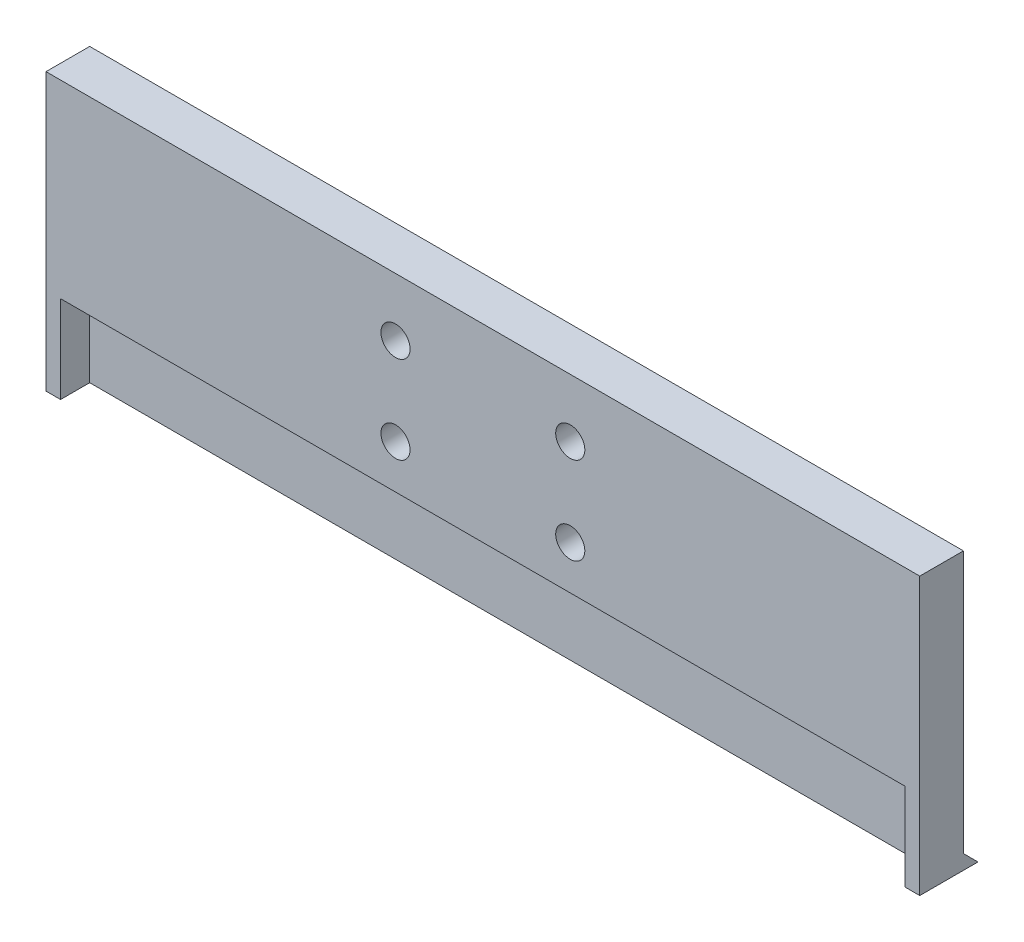
ISO-10303-21;
HEADER;
FILE_DESCRIPTION(('STEP AP214'),'2;1');
FILE_NAME('part.step','',(''),(''),'','','');
FILE_SCHEMA(('AUTOMOTIVE_DESIGN { 1 0 10303 214 1 1 1 1 }'));
ENDSEC;
DATA;
#1=APPLICATION_CONTEXT('core data for automotive mechanical design processes');
#2=APPLICATION_PROTOCOL_DEFINITION('international standard','automotive_design',2000,#1);
#3=PRODUCT_CONTEXT('',#1,'mechanical');
#4=PRODUCT('Part','Part','',(#3));
#5=PRODUCT_RELATED_PRODUCT_CATEGORY('part','',(#4));
#6=PRODUCT_DEFINITION_FORMATION('','',#4);
#7=PRODUCT_DEFINITION_CONTEXT('part definition',#1,'design');
#8=PRODUCT_DEFINITION('design','',#6,#7);
#9=PRODUCT_DEFINITION_SHAPE('','',#8);
#10=(LENGTH_UNIT() NAMED_UNIT(*) SI_UNIT(.MILLI.,.METRE.));
#11=(NAMED_UNIT(*) PLANE_ANGLE_UNIT() SI_UNIT($,.RADIAN.));
#12=(NAMED_UNIT(*) SI_UNIT($,.STERADIAN.) SOLID_ANGLE_UNIT());
#13=UNCERTAINTY_MEASURE_WITH_UNIT(LENGTH_MEASURE(1.E-05),#10,'distance_accuracy_value','');
#14=(GEOMETRIC_REPRESENTATION_CONTEXT(3) GLOBAL_UNCERTAINTY_ASSIGNED_CONTEXT((#13)) GLOBAL_UNIT_ASSIGNED_CONTEXT((#10,
#11,#12)) REPRESENTATION_CONTEXT('',''));
#15=CARTESIAN_POINT('',(0.,0.,0.));
#16=DIRECTION('',(0.,0.,1.));
#17=DIRECTION('',(1.,0.,0.));
#18=AXIS2_PLACEMENT_3D('',#15,#16,#17);
#19=CARTESIAN_POINT('',(0.,0.,0.));
#20=DIRECTION('',(0.,0.,-1.));
#21=DIRECTION('',(-1.,0.,0.));
#22=AXIS2_PLACEMENT_3D('',#19,#20,#21);
#23=PLANE('',#22);
#24=CARTESIAN_POINT('',(120.,75.,0.));
#25=DIRECTION('',(0.,0.,-1.));
#26=DIRECTION('',(-1.,0.,0.));
#27=AXIS2_PLACEMENT_3D('',#24,#25,#26);
#28=CIRCLE('',#27,5.00000000000001);
#29=CARTESIAN_POINT('',(115.,75.,0.));
#30=VERTEX_POINT('',#29);
#31=EDGE_CURVE('E135',#30,#30,#28,.T.);
#32=ORIENTED_EDGE('',*,*,#31,.F.);
#33=EDGE_LOOP('',(#32));
#34=FACE_BOUND('',#33,.T.);
#35=CARTESIAN_POINT('',(120.,45.,0.));
#36=DIRECTION('',(0.,0.,-1.));
#37=DIRECTION('',(-1.,0.,0.));
#38=AXIS2_PLACEMENT_3D('',#35,#36,#37);
#39=CIRCLE('',#38,5.00000000000001);
#40=CARTESIAN_POINT('',(115.,45.,0.));
#41=VERTEX_POINT('',#40);
#42=EDGE_CURVE('E140',#41,#41,#39,.T.);
#43=ORIENTED_EDGE('',*,*,#42,.F.);
#44=EDGE_LOOP('',(#43));
#45=FACE_BOUND('',#44,.T.);
#46=CARTESIAN_POINT('',(180.,45.,0.));
#47=DIRECTION('',(0.,0.,-1.));
#48=DIRECTION('',(-1.,0.,0.));
#49=AXIS2_PLACEMENT_3D('',#46,#47,#48);
#50=CIRCLE('',#49,4.99999999999999);
#51=CARTESIAN_POINT('',(175.,45.,0.));
#52=VERTEX_POINT('',#51);
#53=EDGE_CURVE('E146',#52,#52,#50,.T.);
#54=ORIENTED_EDGE('',*,*,#53,.F.);
#55=EDGE_LOOP('',(#54));
#56=FACE_BOUND('',#55,.T.);
#57=CARTESIAN_POINT('',(180.,75.,0.));
#58=DIRECTION('',(0.,0.,-1.));
#59=DIRECTION('',(-1.,0.,0.));
#60=AXIS2_PLACEMENT_3D('',#57,#58,#59);
#61=CIRCLE('',#60,5.00000000000002);
#62=CARTESIAN_POINT('',(175.,75.,0.));
#63=VERTEX_POINT('',#62);
#64=EDGE_CURVE('E152',#63,#63,#61,.T.);
#65=ORIENTED_EDGE('',*,*,#64,.F.);
#66=EDGE_LOOP('',(#65));
#67=FACE_BOUND('',#66,.T.);
#68=DIRECTION('',(0.,1.,0.));
#69=VECTOR('',#68,1.);
#70=CARTESIAN_POINT('',(300.,0.,0.));
#71=LINE('',#70,#69);
#72=CARTESIAN_POINT('',(300.,5.,0.));
#73=VERTEX_POINT('',#72);
#74=CARTESIAN_POINT('',(300.,95.,0.));
#75=VERTEX_POINT('',#74);
#76=EDGE_CURVE('E214',#73,#75,#71,.T.);
#77=ORIENTED_EDGE('',*,*,#76,.F.);
#78=DIRECTION('',(-1.,0.,0.));
#79=VECTOR('',#78,1.);
#80=CARTESIAN_POINT('',(307.071067811865,5.,0.));
#81=LINE('',#80,#79);
#82=CARTESIAN_POINT('',(0.,5.,0.));
#83=VERTEX_POINT('',#82);
#84=EDGE_CURVE('E178',#73,#83,#81,.T.);
#85=ORIENTED_EDGE('',*,*,#84,.T.);
#86=DIRECTION('',(0.,-1.,0.));
#87=VECTOR('',#86,1.);
#88=CARTESIAN_POINT('',(0.,0.,0.));
#89=LINE('',#88,#87);
#90=CARTESIAN_POINT('',(0.,95.,0.));
#91=VERTEX_POINT('',#90);
#92=EDGE_CURVE('E186',#91,#83,#89,.T.);
#93=ORIENTED_EDGE('',*,*,#92,.F.);
#94=DIRECTION('',(-1.,0.,0.));
#95=VECTOR('',#94,1.);
#96=CARTESIAN_POINT('',(0.,95.,0.));
#97=LINE('',#96,#95);
#98=EDGE_CURVE('E219',#75,#91,#97,.T.);
#99=ORIENTED_EDGE('',*,*,#98,.F.);
#100=EDGE_LOOP('',(#77,#85,#93,#99));
#101=FACE_BOUND('',#100,.T.);
#102=ADVANCED_FACE('F35',(#34,#45,#56,#67,#101),#23,.T.);
#103=CARTESIAN_POINT('',(0.,0.,5.));
#104=DIRECTION('',(1.,0.,0.));
#105=DIRECTION('',(0.,0.,-1.));
#106=AXIS2_PLACEMENT_3D('',#103,#104,#105);
#107=PLANE('',#106);
#108=ORIENTED_EDGE('',*,*,#92,.T.);
#109=DIRECTION('',(0.,0.707106781186548,0.707106781186548));
#110=VECTOR('',#109,1.);
#111=CARTESIAN_POINT('',(0.,2.5,-2.5));
#112=LINE('',#111,#110);
#113=CARTESIAN_POINT('',(0.,0.,-5.));
#114=VERTEX_POINT('',#113);
#115=EDGE_CURVE('E57',#114,#83,#112,.T.);
#116=ORIENTED_EDGE('',*,*,#115,.F.);
#117=DIRECTION('',(0.,0.,-1.));
#118=VECTOR('',#117,1.);
#119=CARTESIAN_POINT('',(0.,0.,5.));
#120=LINE('',#119,#118);
#121=CARTESIAN_POINT('',(0.,0.,15.));
#122=VERTEX_POINT('',#121);
#123=EDGE_CURVE('E189',#122,#114,#120,.T.);
#124=ORIENTED_EDGE('',*,*,#123,.F.);
#125=DIRECTION('',(0.,-1.,0.));
#126=VECTOR('',#125,1.);
#127=CARTESIAN_POINT('',(0.,0.,15.));
#128=LINE('',#127,#126);
#129=CARTESIAN_POINT('',(0.,95.,15.));
#130=VERTEX_POINT('',#129);
#131=EDGE_CURVE('E163',#130,#122,#128,.T.);
#132=ORIENTED_EDGE('',*,*,#131,.F.);
#133=DIRECTION('',(0.,0.,-1.));
#134=VECTOR('',#133,1.);
#135=CARTESIAN_POINT('',(0.,95.,5.));
#136=LINE('',#135,#134);
#137=EDGE_CURVE('E204',#130,#91,#136,.T.);
#138=ORIENTED_EDGE('',*,*,#137,.T.);
#139=EDGE_LOOP('',(#108,#116,#124,#132,#138));
#140=FACE_BOUND('',#139,.T.);
#141=ADVANCED_FACE('F37',(#140),#107,.F.);
#142=CARTESIAN_POINT('',(0.,0.,5.));
#143=DIRECTION('',(0.,1.,0.));
#144=DIRECTION('',(0.,0.,1.));
#145=AXIS2_PLACEMENT_3D('',#142,#143,#144);
#146=PLANE('',#145);
#147=DIRECTION('',(1.,0.,0.));
#148=VECTOR('',#147,1.);
#149=CARTESIAN_POINT('',(0.,0.,15.));
#150=LINE('',#149,#148);
#151=CARTESIAN_POINT('',(295.,0.,15.));
#152=VERTEX_POINT('',#151);
#153=CARTESIAN_POINT('',(300.,0.,15.));
#154=VERTEX_POINT('',#153);
#155=EDGE_CURVE('E166',#152,#154,#150,.T.);
#156=ORIENTED_EDGE('',*,*,#155,.F.);
#157=DIRECTION('',(0.,0.,1.));
#158=VECTOR('',#157,1.);
#159=CARTESIAN_POINT('',(295.,0.,28.0208625035403));
#160=LINE('',#159,#158);
#161=CARTESIAN_POINT('',(295.,0.,5.));
#162=VERTEX_POINT('',#161);
#163=EDGE_CURVE('E130',#162,#152,#160,.T.);
#164=ORIENTED_EDGE('',*,*,#163,.F.);
#165=DIRECTION('',(1.,0.,0.));
#166=VECTOR('',#165,1.);
#167=CARTESIAN_POINT('',(295.,0.,5.));
#168=LINE('',#167,#166);
#169=CARTESIAN_POINT('',(5.,0.,4.99999999999996));
#170=VERTEX_POINT('',#169);
#171=EDGE_CURVE('E133',#170,#162,#168,.T.);
#172=ORIENTED_EDGE('',*,*,#171,.F.);
#173=DIRECTION('',(0.,0.,-1.));
#174=VECTOR('',#173,1.);
#175=CARTESIAN_POINT('',(5.,0.,28.0208625035403));
#176=LINE('',#175,#174);
#177=CARTESIAN_POINT('',(5.,0.,15.));
#178=VERTEX_POINT('',#177);
#179=EDGE_CURVE('E120',#178,#170,#176,.T.);
#180=ORIENTED_EDGE('',*,*,#179,.F.);
#181=EDGE_CURVE('E167',#122,#178,#150,.T.);
#182=ORIENTED_EDGE('',*,*,#181,.F.);
#183=ORIENTED_EDGE('',*,*,#123,.T.);
#184=DIRECTION('',(-1.,0.,0.));
#185=VECTOR('',#184,1.);
#186=CARTESIAN_POINT('',(307.071067811865,0.,-5.));
#187=LINE('',#186,#185);
#188=CARTESIAN_POINT('',(300.,0.,-5.));
#189=VERTEX_POINT('',#188);
#190=EDGE_CURVE('E175',#189,#114,#187,.T.);
#191=ORIENTED_EDGE('',*,*,#190,.F.);
#192=DIRECTION('',(0.,0.,-1.));
#193=VECTOR('',#192,1.);
#194=CARTESIAN_POINT('',(300.,0.,5.));
#195=LINE('',#194,#193);
#196=EDGE_CURVE('E207',#154,#189,#195,.T.);
#197=ORIENTED_EDGE('',*,*,#196,.F.);
#198=EDGE_LOOP('',(#156,#164,#172,#180,#182,#183,#191,#197));
#199=FACE_BOUND('',#198,.T.);
#200=ADVANCED_FACE('F194',(#199),#146,.F.);
#201=CARTESIAN_POINT('',(300.,0.,5.));
#202=DIRECTION('',(-1.,0.,0.));
#203=DIRECTION('',(0.,0.,1.));
#204=AXIS2_PLACEMENT_3D('',#201,#202,#203);
#205=PLANE('',#204);
#206=ORIENTED_EDGE('',*,*,#196,.T.);
#207=DIRECTION('',(0.,-0.707106781186547,-0.707106781186547));
#208=VECTOR('',#207,1.);
#209=CARTESIAN_POINT('',(300.,2.5,-2.5));
#210=LINE('',#209,#208);
#211=EDGE_CURVE('E181',#73,#189,#210,.T.);
#212=ORIENTED_EDGE('',*,*,#211,.F.);
#213=ORIENTED_EDGE('',*,*,#76,.T.);
#214=DIRECTION('',(0.,0.,-1.));
#215=VECTOR('',#214,1.);
#216=CARTESIAN_POINT('',(300.,95.,5.));
#217=LINE('',#216,#215);
#218=CARTESIAN_POINT('',(300.,95.,15.));
#219=VERTEX_POINT('',#218);
#220=EDGE_CURVE('E209',#219,#75,#217,.T.);
#221=ORIENTED_EDGE('',*,*,#220,.F.);
#222=DIRECTION('',(0.,1.,0.));
#223=VECTOR('',#222,1.);
#224=CARTESIAN_POINT('',(300.,0.,15.));
#225=LINE('',#224,#223);
#226=EDGE_CURVE('E170',#154,#219,#225,.T.);
#227=ORIENTED_EDGE('',*,*,#226,.F.);
#228=EDGE_LOOP('',(#206,#212,#213,#221,#227));
#229=FACE_BOUND('',#228,.T.);
#230=ADVANCED_FACE('F231',(#229),#205,.F.);
#231=CARTESIAN_POINT('',(0.,95.,5.));
#232=DIRECTION('',(0.,-1.,0.));
#233=DIRECTION('',(0.,0.,-1.));
#234=AXIS2_PLACEMENT_3D('',#231,#232,#233);
#235=PLANE('',#234);
#236=ORIENTED_EDGE('',*,*,#98,.T.);
#237=ORIENTED_EDGE('',*,*,#137,.F.);
#238=DIRECTION('',(-1.,0.,0.));
#239=VECTOR('',#238,1.);
#240=CARTESIAN_POINT('',(0.,95.,15.));
#241=LINE('',#240,#239);
#242=EDGE_CURVE('E158',#219,#130,#241,.T.);
#243=ORIENTED_EDGE('',*,*,#242,.F.);
#244=ORIENTED_EDGE('',*,*,#220,.T.);
#245=EDGE_LOOP('',(#236,#237,#243,#244));
#246=FACE_BOUND('',#245,.T.);
#247=ADVANCED_FACE('F224',(#246),#235,.F.);
#248=CARTESIAN_POINT('',(307.071067811865,2.5,-2.5));
#249=DIRECTION('',(0.,-0.707106781186547,0.707106781186547));
#250=DIRECTION('',(0.,-0.707106781186547,-0.707106781186547));
#251=AXIS2_PLACEMENT_3D('',#248,#249,#250);
#252=PLANE('',#251);
#253=ORIENTED_EDGE('',*,*,#84,.F.);
#254=ORIENTED_EDGE('',*,*,#211,.T.);
#255=ORIENTED_EDGE('',*,*,#190,.T.);
#256=ORIENTED_EDGE('',*,*,#115,.T.);
#257=EDGE_LOOP('',(#253,#254,#255,#256));
#258=FACE_BOUND('',#257,.T.);
#259=ADVANCED_FACE('F229',(#258),#252,.F.);
#260=CARTESIAN_POINT('',(0.,0.,15.));
#261=DIRECTION('',(0.,0.,1.));
#262=DIRECTION('',(1.,0.,0.));
#263=AXIS2_PLACEMENT_3D('',#260,#261,#262);
#264=PLANE('',#263);
#265=DIRECTION('',(0.,1.,0.));
#266=VECTOR('',#265,1.);
#267=CARTESIAN_POINT('',(295.,0.,15.));
#268=LINE('',#267,#266);
#269=CARTESIAN_POINT('',(295.,30.,15.));
#270=VERTEX_POINT('',#269);
#271=EDGE_CURVE('E11',#152,#270,#268,.T.);
#272=ORIENTED_EDGE('',*,*,#271,.F.);
#273=ORIENTED_EDGE('',*,*,#155,.T.);
#274=ORIENTED_EDGE('',*,*,#226,.T.);
#275=ORIENTED_EDGE('',*,*,#242,.T.);
#276=ORIENTED_EDGE('',*,*,#131,.T.);
#277=ORIENTED_EDGE('',*,*,#181,.T.);
#278=DIRECTION('',(0.,-1.,0.));
#279=VECTOR('',#278,1.);
#280=CARTESIAN_POINT('',(5.,0.,15.));
#281=LINE('',#280,#279);
#282=CARTESIAN_POINT('',(5.,30.,15.));
#283=VERTEX_POINT('',#282);
#284=EDGE_CURVE('E43',#283,#178,#281,.T.);
#285=ORIENTED_EDGE('',*,*,#284,.F.);
#286=DIRECTION('',(-1.,0.,0.));
#287=VECTOR('',#286,1.);
#288=CARTESIAN_POINT('',(0.,30.,15.));
#289=LINE('',#288,#287);
#290=EDGE_CURVE('E112',#270,#283,#289,.T.);
#291=ORIENTED_EDGE('',*,*,#290,.F.);
#292=EDGE_LOOP('',(#272,#273,#274,#275,#276,#277,#285,#291));
#293=FACE_BOUND('',#292,.T.);
#294=CARTESIAN_POINT('',(120.,75.,15.));
#295=DIRECTION('',(0.,0.,-1.));
#296=DIRECTION('',(-1.,0.,0.));
#297=AXIS2_PLACEMENT_3D('',#294,#295,#296);
#298=CIRCLE('',#297,5.00000000000001);
#299=CARTESIAN_POINT('',(115.,75.,15.));
#300=VERTEX_POINT('',#299);
#301=EDGE_CURVE('E137',#300,#300,#298,.T.);
#302=ORIENTED_EDGE('',*,*,#301,.T.);
#303=EDGE_LOOP('',(#302));
#304=FACE_BOUND('',#303,.T.);
#305=CARTESIAN_POINT('',(120.,45.,15.));
#306=DIRECTION('',(0.,0.,-1.));
#307=DIRECTION('',(-1.,0.,0.));
#308=AXIS2_PLACEMENT_3D('',#305,#306,#307);
#309=CIRCLE('',#308,5.00000000000001);
#310=CARTESIAN_POINT('',(115.,45.,15.));
#311=VERTEX_POINT('',#310);
#312=EDGE_CURVE('E143',#311,#311,#309,.T.);
#313=ORIENTED_EDGE('',*,*,#312,.T.);
#314=EDGE_LOOP('',(#313));
#315=FACE_BOUND('',#314,.T.);
#316=CARTESIAN_POINT('',(180.,45.,15.));
#317=DIRECTION('',(0.,0.,-1.));
#318=DIRECTION('',(-1.,0.,0.));
#319=AXIS2_PLACEMENT_3D('',#316,#317,#318);
#320=CIRCLE('',#319,4.99999999999999);
#321=CARTESIAN_POINT('',(175.,45.,15.));
#322=VERTEX_POINT('',#321);
#323=EDGE_CURVE('E149',#322,#322,#320,.T.);
#324=ORIENTED_EDGE('',*,*,#323,.T.);
#325=EDGE_LOOP('',(#324));
#326=FACE_BOUND('',#325,.T.);
#327=CARTESIAN_POINT('',(180.,75.,15.));
#328=DIRECTION('',(0.,0.,-1.));
#329=DIRECTION('',(-1.,0.,0.));
#330=AXIS2_PLACEMENT_3D('',#327,#328,#329);
#331=CIRCLE('',#330,5.00000000000002);
#332=CARTESIAN_POINT('',(175.,75.,15.));
#333=VERTEX_POINT('',#332);
#334=EDGE_CURVE('E155',#333,#333,#331,.T.);
#335=ORIENTED_EDGE('',*,*,#334,.T.);
#336=EDGE_LOOP('',(#335));
#337=FACE_BOUND('',#336,.T.);
#338=ADVANCED_FACE('F197',(#293,#304,#315,#326,#337),#264,.T.);
#339=CARTESIAN_POINT('',(180.,75.,15.));
#340=DIRECTION('',(0.,0.,-1.));
#341=DIRECTION('',(-1.,0.,0.));
#342=AXIS2_PLACEMENT_3D('',#339,#340,#341);
#343=CYLINDRICAL_SURFACE('',#342,5.00000000000002);
#344=ORIENTED_EDGE('',*,*,#334,.F.);
#345=EDGE_LOOP('',(#344));
#346=FACE_BOUND('',#345,.T.);
#347=ORIENTED_EDGE('',*,*,#64,.T.);
#348=EDGE_LOOP('',(#347));
#349=FACE_BOUND('',#348,.T.);
#350=ADVANCED_FACE('F285',(#346,#349),#343,.F.);
#351=CARTESIAN_POINT('',(180.,45.,15.));
#352=DIRECTION('',(0.,0.,-1.));
#353=DIRECTION('',(-1.,0.,0.));
#354=AXIS2_PLACEMENT_3D('',#351,#352,#353);
#355=CYLINDRICAL_SURFACE('',#354,4.99999999999999);
#356=ORIENTED_EDGE('',*,*,#323,.F.);
#357=EDGE_LOOP('',(#356));
#358=FACE_BOUND('',#357,.T.);
#359=ORIENTED_EDGE('',*,*,#53,.T.);
#360=EDGE_LOOP('',(#359));
#361=FACE_BOUND('',#360,.T.);
#362=ADVANCED_FACE('F291',(#358,#361),#355,.F.);
#363=CARTESIAN_POINT('',(120.,45.,15.));
#364=DIRECTION('',(0.,0.,-1.));
#365=DIRECTION('',(-1.,0.,0.));
#366=AXIS2_PLACEMENT_3D('',#363,#364,#365);
#367=CYLINDRICAL_SURFACE('',#366,5.00000000000001);
#368=ORIENTED_EDGE('',*,*,#312,.F.);
#369=EDGE_LOOP('',(#368));
#370=FACE_BOUND('',#369,.T.);
#371=ORIENTED_EDGE('',*,*,#42,.T.);
#372=EDGE_LOOP('',(#371));
#373=FACE_BOUND('',#372,.T.);
#374=ADVANCED_FACE('F242',(#370,#373),#367,.F.);
#375=CARTESIAN_POINT('',(120.,75.,15.));
#376=DIRECTION('',(0.,0.,-1.));
#377=DIRECTION('',(-1.,0.,0.));
#378=AXIS2_PLACEMENT_3D('',#375,#376,#377);
#379=CYLINDRICAL_SURFACE('',#378,5.00000000000001);
#380=ORIENTED_EDGE('',*,*,#301,.F.);
#381=EDGE_LOOP('',(#380));
#382=FACE_BOUND('',#381,.T.);
#383=ORIENTED_EDGE('',*,*,#31,.T.);
#384=EDGE_LOOP('',(#383));
#385=FACE_BOUND('',#384,.T.);
#386=ADVANCED_FACE('F235',(#382,#385),#379,.F.);
#387=CARTESIAN_POINT('',(295.,30.,28.0208625035403));
#388=DIRECTION('',(1.,0.,0.));
#389=DIRECTION('',(0.,0.,-1.));
#390=AXIS2_PLACEMENT_3D('',#387,#388,#389);
#391=PLANE('',#390);
#392=ORIENTED_EDGE('',*,*,#271,.T.);
#393=DIRECTION('',(0.,0.,1.));
#394=VECTOR('',#393,1.);
#395=CARTESIAN_POINT('',(295.,30.,28.0208625035403));
#396=LINE('',#395,#394);
#397=CARTESIAN_POINT('',(295.,30.,5.));
#398=VERTEX_POINT('',#397);
#399=EDGE_CURVE('E50',#398,#270,#396,.T.);
#400=ORIENTED_EDGE('',*,*,#399,.F.);
#401=DIRECTION('',(0.,-1.,0.));
#402=VECTOR('',#401,1.);
#403=CARTESIAN_POINT('',(295.,30.,5.));
#404=LINE('',#403,#402);
#405=EDGE_CURVE('E124',#398,#162,#404,.T.);
#406=ORIENTED_EDGE('',*,*,#405,.T.);
#407=ORIENTED_EDGE('',*,*,#163,.T.);
#408=EDGE_LOOP('',(#392,#400,#406,#407));
#409=FACE_BOUND('',#408,.T.);
#410=ADVANCED_FACE('F233',(#409),#391,.F.);
#411=CARTESIAN_POINT('',(295.,30.,5.));
#412=DIRECTION('',(0.,0.,-1.));
#413=DIRECTION('',(-1.,0.,0.));
#414=AXIS2_PLACEMENT_3D('',#411,#412,#413);
#415=PLANE('',#414);
#416=ORIENTED_EDGE('',*,*,#171,.T.);
#417=ORIENTED_EDGE('',*,*,#405,.F.);
#418=DIRECTION('',(1.,0.,0.));
#419=VECTOR('',#418,1.);
#420=CARTESIAN_POINT('',(295.,30.,5.));
#421=LINE('',#420,#419);
#422=CARTESIAN_POINT('',(5.,30.,4.99999999999996));
#423=VERTEX_POINT('',#422);
#424=EDGE_CURVE('E110',#423,#398,#421,.T.);
#425=ORIENTED_EDGE('',*,*,#424,.F.);
#426=DIRECTION('',(0.,-1.,0.));
#427=VECTOR('',#426,1.);
#428=CARTESIAN_POINT('',(5.,30.,4.99999999999996));
#429=LINE('',#428,#427);
#430=EDGE_CURVE('E117',#423,#170,#429,.T.);
#431=ORIENTED_EDGE('',*,*,#430,.T.);
#432=EDGE_LOOP('',(#416,#417,#425,#431));
#433=FACE_BOUND('',#432,.T.);
#434=ADVANCED_FACE('F126',(#433),#415,.F.);
#435=CARTESIAN_POINT('',(5.,30.,28.0208625035403));
#436=DIRECTION('',(-1.,0.,0.));
#437=DIRECTION('',(0.,0.,1.));
#438=AXIS2_PLACEMENT_3D('',#435,#436,#437);
#439=PLANE('',#438);
#440=ORIENTED_EDGE('',*,*,#284,.T.);
#441=ORIENTED_EDGE('',*,*,#179,.T.);
#442=ORIENTED_EDGE('',*,*,#430,.F.);
#443=DIRECTION('',(0.,0.,-1.));
#444=VECTOR('',#443,1.);
#445=CARTESIAN_POINT('',(5.,30.,28.0208625035403));
#446=LINE('',#445,#444);
#447=EDGE_CURVE('E106',#283,#423,#446,.T.);
#448=ORIENTED_EDGE('',*,*,#447,.F.);
#449=EDGE_LOOP('',(#440,#441,#442,#448));
#450=FACE_BOUND('',#449,.T.);
#451=ADVANCED_FACE('F118',(#450),#439,.F.);
#452=CARTESIAN_POINT('',(0.,30.,0.));
#453=DIRECTION('',(0.,1.,0.));
#454=DIRECTION('',(0.,0.,1.));
#455=AXIS2_PLACEMENT_3D('',#452,#453,#454);
#456=PLANE('',#455);
#457=ORIENTED_EDGE('',*,*,#290,.T.);
#458=ORIENTED_EDGE('',*,*,#447,.T.);
#459=ORIENTED_EDGE('',*,*,#424,.T.);
#460=ORIENTED_EDGE('',*,*,#399,.T.);
#461=EDGE_LOOP('',(#457,#458,#459,#460));
#462=FACE_BOUND('',#461,.T.);
#463=ADVANCED_FACE('F108',(#462),#456,.F.);
#464=CLOSED_SHELL('',(#102,#141,#200,#230,#247,#259,#338,#350,#362,#374,#386,#410,#434,#451,#463));
#465=MANIFOLD_SOLID_BREP('B2',#464);
#466=ADVANCED_BREP_SHAPE_REPRESENTATION('',(#18,#465),#14);
#467=SHAPE_DEFINITION_REPRESENTATION(#9,#466);
ENDSEC;
END-ISO-10303-21;
